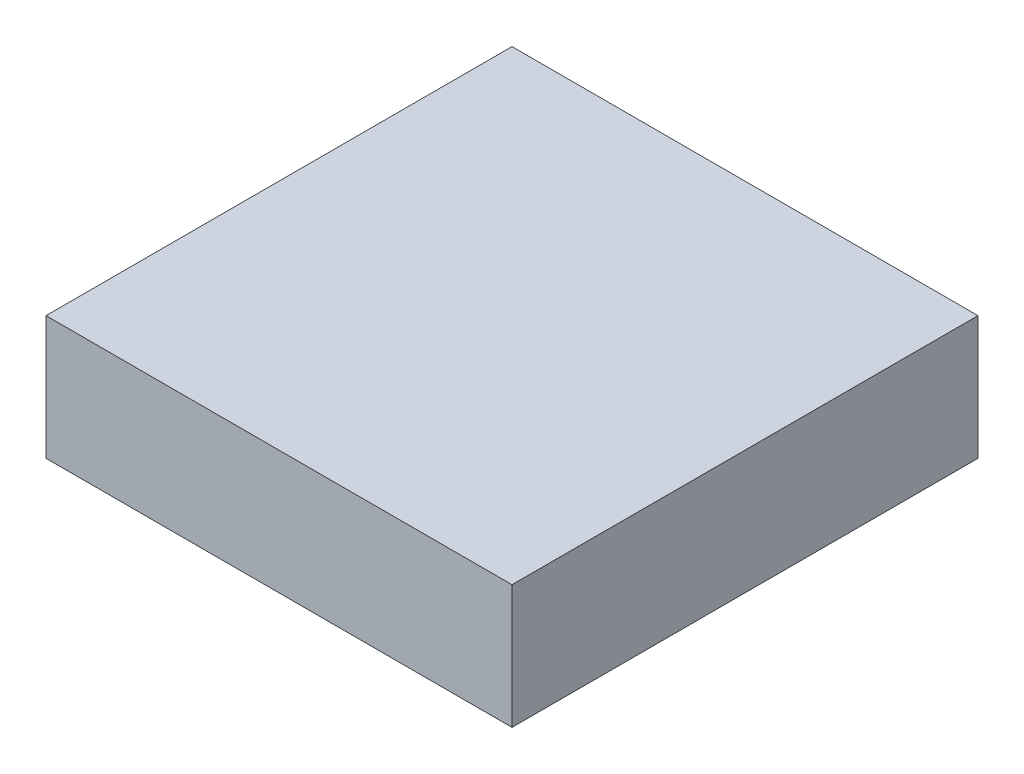
ISO-10303-21;
HEADER;
FILE_DESCRIPTION(('STEP AP214'),'2;1');
FILE_NAME('part.step','',(''),(''),'','','');
FILE_SCHEMA(('AUTOMOTIVE_DESIGN { 1 0 10303 214 1 1 1 1 }'));
ENDSEC;
DATA;
#1=APPLICATION_CONTEXT('core data for automotive mechanical design processes');
#2=APPLICATION_PROTOCOL_DEFINITION('international standard','automotive_design',2000,#1);
#3=PRODUCT_CONTEXT('',#1,'mechanical');
#4=PRODUCT('Part','Part','',(#3));
#5=PRODUCT_RELATED_PRODUCT_CATEGORY('part','',(#4));
#6=PRODUCT_DEFINITION_FORMATION('','',#4);
#7=PRODUCT_DEFINITION_CONTEXT('part definition',#1,'design');
#8=PRODUCT_DEFINITION('design','',#6,#7);
#9=PRODUCT_DEFINITION_SHAPE('','',#8);
#10=(LENGTH_UNIT() NAMED_UNIT(*) SI_UNIT(.MILLI.,.METRE.));
#11=(NAMED_UNIT(*) PLANE_ANGLE_UNIT() SI_UNIT($,.RADIAN.));
#12=(NAMED_UNIT(*) SI_UNIT($,.STERADIAN.) SOLID_ANGLE_UNIT());
#13=UNCERTAINTY_MEASURE_WITH_UNIT(LENGTH_MEASURE(1.E-05),#10,'distance_accuracy_value','');
#14=(GEOMETRIC_REPRESENTATION_CONTEXT(3) GLOBAL_UNCERTAINTY_ASSIGNED_CONTEXT((#13)) GLOBAL_UNIT_ASSIGNED_CONTEXT((#10,
#11,#12)) REPRESENTATION_CONTEXT('',''));
#15=CARTESIAN_POINT('',(0.,0.,0.));
#16=DIRECTION('',(0.,0.,1.));
#17=DIRECTION('',(1.,0.,0.));
#18=AXIS2_PLACEMENT_3D('',#15,#16,#17);
#19=CARTESIAN_POINT('',(-25.,6.63,-25.));
#20=DIRECTION('',(1.,0.,0.));
#21=DIRECTION('',(0.,0.,-1.));
#22=AXIS2_PLACEMENT_3D('',#19,#20,#21);
#23=PLANE('',#22);
#24=DIRECTION('',(0.,0.,1.));
#25=VECTOR('',#24,1.);
#26=CARTESIAN_POINT('',(-25.,-6.63,-25.));
#27=LINE('',#26,#25);
#28=CARTESIAN_POINT('',(-25.,-6.63,-25.));
#29=VERTEX_POINT('',#28);
#30=CARTESIAN_POINT('',(-25.,-6.63,25.));
#31=VERTEX_POINT('',#30);
#32=EDGE_CURVE('E97',#29,#31,#27,.T.);
#33=ORIENTED_EDGE('',*,*,#32,.T.);
#34=DIRECTION('',(0.,-1.,0.));
#35=VECTOR('',#34,1.);
#36=CARTESIAN_POINT('',(-25.,6.63,25.));
#37=LINE('',#36,#35);
#38=CARTESIAN_POINT('',(-25.,6.63,25.));
#39=VERTEX_POINT('',#38);
#40=EDGE_CURVE('E11',#39,#31,#37,.T.);
#41=ORIENTED_EDGE('',*,*,#40,.F.);
#42=DIRECTION('',(0.,0.,1.));
#43=VECTOR('',#42,1.);
#44=CARTESIAN_POINT('',(-25.,6.63,-25.));
#45=LINE('',#44,#43);
#46=CARTESIAN_POINT('',(-25.,6.63,-25.));
#47=VERTEX_POINT('',#46);
#48=EDGE_CURVE('E85',#47,#39,#45,.T.);
#49=ORIENTED_EDGE('',*,*,#48,.F.);
#50=DIRECTION('',(0.,-1.,0.));
#51=VECTOR('',#50,1.);
#52=CARTESIAN_POINT('',(-25.,6.63,-25.));
#53=LINE('',#52,#51);
#54=EDGE_CURVE('E93',#47,#29,#53,.T.);
#55=ORIENTED_EDGE('',*,*,#54,.T.);
#56=EDGE_LOOP('',(#33,#41,#49,#55));
#57=FACE_BOUND('',#56,.T.);
#58=ADVANCED_FACE('F34',(#57),#23,.F.);
#59=CARTESIAN_POINT('',(-25.,6.63,25.));
#60=DIRECTION('',(0.,0.,-1.));
#61=DIRECTION('',(-1.,0.,0.));
#62=AXIS2_PLACEMENT_3D('',#59,#60,#61);
#63=PLANE('',#62);
#64=DIRECTION('',(1.,0.,0.));
#65=VECTOR('',#64,1.);
#66=CARTESIAN_POINT('',(-25.,-6.63,25.));
#67=LINE('',#66,#65);
#68=CARTESIAN_POINT('',(25.,-6.63,25.));
#69=VERTEX_POINT('',#68);
#70=EDGE_CURVE('E89',#31,#69,#67,.T.);
#71=ORIENTED_EDGE('',*,*,#70,.T.);
#72=DIRECTION('',(0.,-1.,0.));
#73=VECTOR('',#72,1.);
#74=CARTESIAN_POINT('',(25.,6.63,25.));
#75=LINE('',#74,#73);
#76=CARTESIAN_POINT('',(25.,6.63,25.));
#77=VERTEX_POINT('',#76);
#78=EDGE_CURVE('E42',#77,#69,#75,.T.);
#79=ORIENTED_EDGE('',*,*,#78,.F.);
#80=DIRECTION('',(1.,0.,0.));
#81=VECTOR('',#80,1.);
#82=CARTESIAN_POINT('',(-25.,6.63,25.));
#83=LINE('',#82,#81);
#84=EDGE_CURVE('E80',#39,#77,#83,.T.);
#85=ORIENTED_EDGE('',*,*,#84,.F.);
#86=ORIENTED_EDGE('',*,*,#40,.T.);
#87=EDGE_LOOP('',(#71,#79,#85,#86));
#88=FACE_BOUND('',#87,.T.);
#89=ADVANCED_FACE('F88',(#88),#63,.F.);
#90=CARTESIAN_POINT('',(25.,6.63,-25.));
#91=DIRECTION('',(-1.,0.,0.));
#92=DIRECTION('',(0.,0.,1.));
#93=AXIS2_PLACEMENT_3D('',#90,#91,#92);
#94=PLANE('',#93);
#95=DIRECTION('',(0.,0.,-1.));
#96=VECTOR('',#95,1.);
#97=CARTESIAN_POINT('',(25.,-6.63,-25.));
#98=LINE('',#97,#96);
#99=CARTESIAN_POINT('',(25.,-6.63,-25.));
#100=VERTEX_POINT('',#99);
#101=EDGE_CURVE('E67',#69,#100,#98,.T.);
#102=ORIENTED_EDGE('',*,*,#101,.T.);
#103=DIRECTION('',(0.,-1.,0.));
#104=VECTOR('',#103,1.);
#105=CARTESIAN_POINT('',(25.,6.63,-25.));
#106=LINE('',#105,#104);
#107=CARTESIAN_POINT('',(25.,6.63,-25.));
#108=VERTEX_POINT('',#107);
#109=EDGE_CURVE('E90',#108,#100,#106,.T.);
#110=ORIENTED_EDGE('',*,*,#109,.F.);
#111=DIRECTION('',(0.,0.,-1.));
#112=VECTOR('',#111,1.);
#113=CARTESIAN_POINT('',(25.,6.63,-25.));
#114=LINE('',#113,#112);
#115=EDGE_CURVE('E83',#77,#108,#114,.T.);
#116=ORIENTED_EDGE('',*,*,#115,.F.);
#117=ORIENTED_EDGE('',*,*,#78,.T.);
#118=EDGE_LOOP('',(#102,#110,#116,#117));
#119=FACE_BOUND('',#118,.T.);
#120=ADVANCED_FACE('F91',(#119),#94,.F.);
#121=CARTESIAN_POINT('',(-25.,6.63,-25.));
#122=DIRECTION('',(0.,0.,1.));
#123=DIRECTION('',(1.,0.,0.));
#124=AXIS2_PLACEMENT_3D('',#121,#122,#123);
#125=PLANE('',#124);
#126=DIRECTION('',(-1.,0.,0.));
#127=VECTOR('',#126,1.);
#128=CARTESIAN_POINT('',(-25.,-6.63,-25.));
#129=LINE('',#128,#127);
#130=EDGE_CURVE('E73',#100,#29,#129,.T.);
#131=ORIENTED_EDGE('',*,*,#130,.T.);
#132=ORIENTED_EDGE('',*,*,#54,.F.);
#133=DIRECTION('',(-1.,0.,0.));
#134=VECTOR('',#133,1.);
#135=CARTESIAN_POINT('',(-25.,6.63,-25.));
#136=LINE('',#135,#134);
#137=EDGE_CURVE('E50',#108,#47,#136,.T.);
#138=ORIENTED_EDGE('',*,*,#137,.F.);
#139=ORIENTED_EDGE('',*,*,#109,.T.);
#140=EDGE_LOOP('',(#131,#132,#138,#139));
#141=FACE_BOUND('',#140,.T.);
#142=ADVANCED_FACE('F104',(#141),#125,.F.);
#143=CARTESIAN_POINT('',(-25.,6.63,25.));
#144=DIRECTION('',(0.,1.,0.));
#145=DIRECTION('',(0.,0.,1.));
#146=AXIS2_PLACEMENT_3D('',#143,#144,#145);
#147=PLANE('',#146);
#148=ORIENTED_EDGE('',*,*,#48,.T.);
#149=ORIENTED_EDGE('',*,*,#84,.T.);
#150=ORIENTED_EDGE('',*,*,#115,.T.);
#151=ORIENTED_EDGE('',*,*,#137,.T.);
#152=EDGE_LOOP('',(#148,#149,#150,#151));
#153=FACE_BOUND('',#152,.T.);
#154=ADVANCED_FACE('F81',(#153),#147,.T.);
#155=CARTESIAN_POINT('',(-25.,-6.63,25.));
#156=DIRECTION('',(0.,1.,0.));
#157=DIRECTION('',(0.,0.,1.));
#158=AXIS2_PLACEMENT_3D('',#155,#156,#157);
#159=PLANE('',#158);
#160=ORIENTED_EDGE('',*,*,#32,.F.);
#161=ORIENTED_EDGE('',*,*,#130,.F.);
#162=ORIENTED_EDGE('',*,*,#101,.F.);
#163=ORIENTED_EDGE('',*,*,#70,.F.);
#164=EDGE_LOOP('',(#160,#161,#162,#163));
#165=FACE_BOUND('',#164,.T.);
#166=ADVANCED_FACE('F107',(#165),#159,.F.);
#167=CLOSED_SHELL('',(#58,#89,#120,#142,#154,#166));
#168=MANIFOLD_SOLID_BREP('B2',#167);
#169=ADVANCED_BREP_SHAPE_REPRESENTATION('',(#18,#168),#14);
#170=SHAPE_DEFINITION_REPRESENTATION(#9,#169);
ENDSEC;
END-ISO-10303-21;
